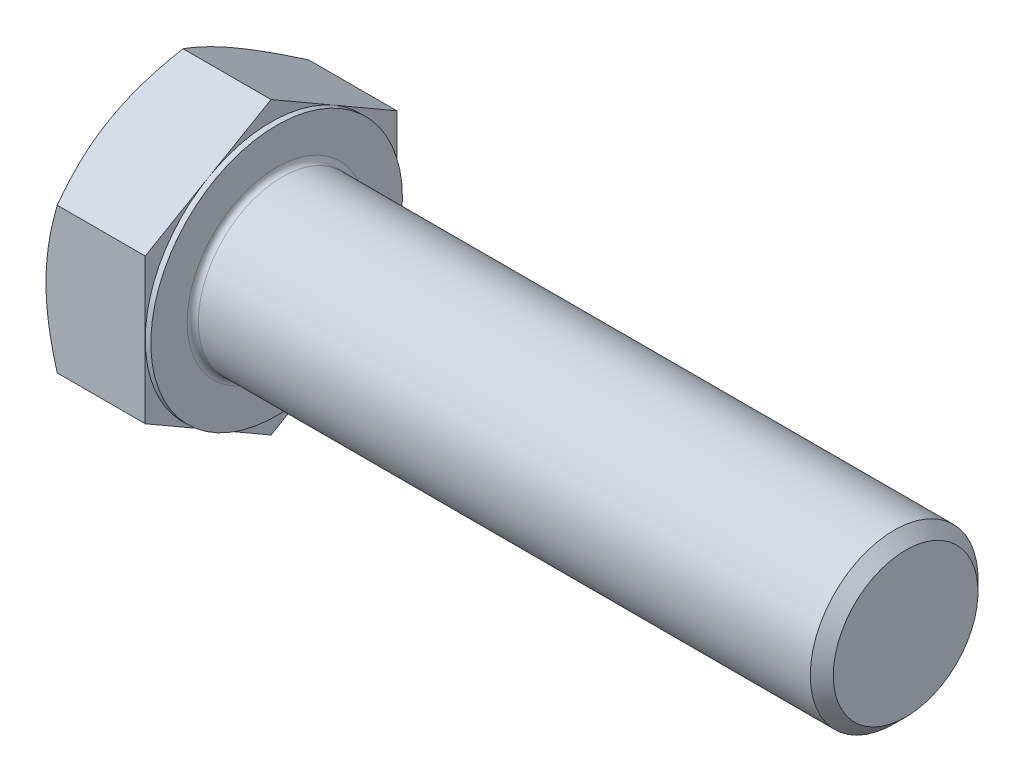
ISO-10303-21;
HEADER;
FILE_DESCRIPTION(('STEP AP214'),'2;1');
FILE_NAME('part.step','',(''),(''),'','','');
FILE_SCHEMA(('AUTOMOTIVE_DESIGN { 1 0 10303 214 1 1 1 1 }'));
ENDSEC;
DATA;
#1=APPLICATION_CONTEXT('core data for automotive mechanical design processes');
#2=APPLICATION_PROTOCOL_DEFINITION('international standard','automotive_design',2000,#1);
#3=PRODUCT_CONTEXT('',#1,'mechanical');
#4=PRODUCT('Part','Part','',(#3));
#5=PRODUCT_RELATED_PRODUCT_CATEGORY('part','',(#4));
#6=PRODUCT_DEFINITION_FORMATION('','',#4);
#7=PRODUCT_DEFINITION_CONTEXT('part definition',#1,'design');
#8=PRODUCT_DEFINITION('design','',#6,#7);
#9=PRODUCT_DEFINITION_SHAPE('','',#8);
#10=(LENGTH_UNIT() NAMED_UNIT(*) SI_UNIT(.MILLI.,.METRE.));
#11=(NAMED_UNIT(*) PLANE_ANGLE_UNIT() SI_UNIT($,.RADIAN.));
#12=(NAMED_UNIT(*) SI_UNIT($,.STERADIAN.) SOLID_ANGLE_UNIT());
#13=UNCERTAINTY_MEASURE_WITH_UNIT(LENGTH_MEASURE(1.E-05),#10,'distance_accuracy_value','');
#14=(GEOMETRIC_REPRESENTATION_CONTEXT(3) GLOBAL_UNCERTAINTY_ASSIGNED_CONTEXT((#13)) GLOBAL_UNIT_ASSIGNED_CONTEXT((#10,
#11,#12)) REPRESENTATION_CONTEXT('',''));
#15=CARTESIAN_POINT('',(0.,0.,0.));
#16=DIRECTION('',(0.,0.,1.));
#17=DIRECTION('',(1.,0.,0.));
#18=AXIS2_PLACEMENT_3D('',#15,#16,#17);
#19=CARTESIAN_POINT('',(-12.1093803991354,180.121959397122,17.5692415429333));
#20=DIRECTION('',(1.,0.,0.));
#21=DIRECTION('',(0.,0.,-1.));
#22=AXIS2_PLACEMENT_3D('',#19,#20,#21);
#23=PLANE('',#22);
#24=CARTESIAN_POINT('',(-12.1093803991354,159.337349706295,17.5692415429333));
#25=DIRECTION('',(1.,0.,0.));
#26=DIRECTION('',(0.,0.,-1.));
#27=AXIS2_PLACEMENT_3D('',#24,#25,#26);
#28=CIRCLE('',#27,12.8);
#29=CARTESIAN_POINT('',(-12.1093803991354,159.337349706295,4.76924154293326));
#30=VERTEX_POINT('',#29);
#31=EDGE_CURVE('E40',#30,#30,#28,.F.);
#32=ORIENTED_EDGE('',*,*,#31,.T.);
#33=EDGE_LOOP('',(#32));
#34=FACE_BOUND('',#33,.T.);
#35=CARTESIAN_POINT('',(-12.1093803991354,159.337349706295,17.5692415429333));
#36=DIRECTION('',(1.,0.,0.));
#37=DIRECTION('',(0.,0.,-1.));
#38=AXIS2_PLACEMENT_3D('',#35,#36,#37);
#39=CIRCLE('',#38,18.);
#40=CARTESIAN_POINT('',(-12.1093803991354,159.337349706295,-0.430758457066735));
#41=VERTEX_POINT('',#40);
#42=EDGE_CURVE('E297',#41,#41,#39,.T.);
#43=ORIENTED_EDGE('',*,*,#42,.T.);
#44=EDGE_LOOP('',(#43));
#45=FACE_BOUND('',#44,.T.);
#46=ADVANCED_FACE('F32',(#34,#45),#23,.T.);
#47=CARTESIAN_POINT('',(-27.1093803991354,159.337349706295,17.5692415429333));
#48=DIRECTION('',(-1.,0.,0.));
#49=DIRECTION('',(0.,0.,1.));
#50=AXIS2_PLACEMENT_3D('',#47,#48,#49);
#51=CYLINDRICAL_SURFACE('',#50,12.);
#52=CARTESIAN_POINT('',(-11.3093803991354,159.337349706295,17.5692415429333));
#53=DIRECTION('',(1.,0.,0.));
#54=DIRECTION('',(0.,0.,-1.));
#55=AXIS2_PLACEMENT_3D('',#52,#53,#54);
#56=CIRCLE('',#55,12.);
#57=CARTESIAN_POINT('',(-11.3093803991354,159.337349706295,5.56924154293326));
#58=VERTEX_POINT('',#57);
#59=EDGE_CURVE('E11',#58,#58,#56,.T.);
#60=ORIENTED_EDGE('',*,*,#59,.T.);
#61=EDGE_LOOP('',(#60));
#62=FACE_BOUND('',#61,.T.);
#63=CARTESIAN_POINT('',(76.2426196008646,159.337349706295,17.5692415429333));
#64=DIRECTION('',(-1.,0.,0.));
#65=DIRECTION('',(0.,0.,1.));
#66=AXIS2_PLACEMENT_3D('',#63,#64,#65);
#67=CIRCLE('',#66,12.);
#68=CARTESIAN_POINT('',(76.2426196008646,159.337349706295,29.5692415429333));
#69=VERTEX_POINT('',#68);
#70=EDGE_CURVE('E276',#69,#69,#67,.T.);
#71=ORIENTED_EDGE('',*,*,#70,.T.);
#72=EDGE_LOOP('',(#71));
#73=FACE_BOUND('',#72,.T.);
#74=ADVANCED_FACE('F250',(#62,#73),#51,.T.);
#75=CARTESIAN_POINT('',(77.8906196008646,159.337349706295,17.5692415429333));
#76=DIRECTION('',(-1.,0.,0.));
#77=DIRECTION('',(0.,0.,1.));
#78=AXIS2_PLACEMENT_3D('',#75,#76,#77);
#79=CONICAL_SURFACE('',#78,10.352,0.785398163397449);
#80=ORIENTED_EDGE('',*,*,#70,.F.);
#81=EDGE_LOOP('',(#80));
#82=FACE_BOUND('',#81,.T.);
#83=CARTESIAN_POINT('',(77.8906196008646,159.337349706295,17.5692415429333));
#84=DIRECTION('',(-1.,0.,0.));
#85=DIRECTION('',(0.,0.,1.));
#86=AXIS2_PLACEMENT_3D('',#83,#84,#85);
#87=CIRCLE('',#86,10.352);
#88=CARTESIAN_POINT('',(77.8906196008646,159.337349706295,27.9212415429333));
#89=VERTEX_POINT('',#88);
#90=EDGE_CURVE('E274',#89,#89,#87,.T.);
#91=ORIENTED_EDGE('',*,*,#90,.T.);
#92=EDGE_LOOP('',(#91));
#93=FACE_BOUND('',#92,.T.);
#94=ADVANCED_FACE('F255',(#82,#93),#79,.T.);
#95=CARTESIAN_POINT('',(77.8906196008646,159.337349706295,17.5692415429333));
#96=DIRECTION('',(-1.,0.,0.));
#97=DIRECTION('',(0.,0.,1.));
#98=AXIS2_PLACEMENT_3D('',#95,#96,#97);
#99=PLANE('',#98);
#100=ORIENTED_EDGE('',*,*,#90,.F.);
#101=EDGE_LOOP('',(#100));
#102=FACE_BOUND('',#101,.T.);
#103=ADVANCED_FACE('F262',(#102),#99,.F.);
#104=CARTESIAN_POINT('',(-12.9093803991354,177.337349706295,17.5692415429333));
#105=DIRECTION('',(1.,0.,0.));
#106=DIRECTION('',(0.,0.,-1.));
#107=AXIS2_PLACEMENT_3D('',#104,#105,#106);
#108=PLANE('',#107);
#109=DIRECTION('',(0.,0.500000000000001,0.866025403784438));
#110=VECTOR('',#109,1.);
#111=CARTESIAN_POINT('',(-12.9093803991354,169.729654551709,-0.430758457066735));
#112=LINE('',#111,#110);
#113=CARTESIAN_POINT('',(-12.9093803991354,169.729654551709,-0.430758457066735));
#114=VERTEX_POINT('',#113);
#115=CARTESIAN_POINT('',(-12.9093803991354,174.925806974415,8.56924154293324));
#116=VERTEX_POINT('',#115);
#117=EDGE_CURVE('E164',#114,#116,#112,.T.);
#118=ORIENTED_EDGE('',*,*,#117,.T.);
#119=CARTESIAN_POINT('',(-12.9093803991354,159.337349706295,17.5692415429333));
#120=DIRECTION('',(-1.,0.,0.));
#121=DIRECTION('',(0.,0.,1.));
#122=AXIS2_PLACEMENT_3D('',#119,#120,#121);
#123=CIRCLE('',#122,18.);
#124=CARTESIAN_POINT('',(-12.9093803991354,159.337349706295,-0.430758457066735));
#125=VERTEX_POINT('',#124);
#126=EDGE_CURVE('E47',#116,#125,#123,.T.);
#127=ORIENTED_EDGE('',*,*,#126,.T.);
#128=DIRECTION('',(0.,1.,0.));
#129=VECTOR('',#128,1.);
#130=CARTESIAN_POINT('',(-12.9093803991354,169.729654551709,-0.430758457066735));
#131=LINE('',#130,#129);
#132=EDGE_CURVE('E300',#125,#114,#131,.T.);
#133=ORIENTED_EDGE('',*,*,#132,.T.);
#134=EDGE_LOOP('',(#118,#127,#133));
#135=FACE_BOUND('',#134,.T.);
#136=ADVANCED_FACE('F265',(#135),#108,.T.);
#137=CARTESIAN_POINT('',(-12.9093803991354,180.121959397122,17.5692415429333));
#138=VERTEX_POINT('',#137);
#139=EDGE_CURVE('E162',#116,#138,#112,.T.);
#140=ORIENTED_EDGE('',*,*,#139,.T.);
#141=DIRECTION('',(0.,-0.500000000000001,0.866025403784438));
#142=VECTOR('',#141,1.);
#143=CARTESIAN_POINT('',(-12.9093803991354,180.121959397122,17.5692415429333));
#144=LINE('',#143,#142);
#145=CARTESIAN_POINT('',(-12.9093803991354,174.925806974415,26.5692415429333));
#146=VERTEX_POINT('',#145);
#147=EDGE_CURVE('E161',#138,#146,#144,.T.);
#148=ORIENTED_EDGE('',*,*,#147,.T.);
#149=EDGE_CURVE('E150',#146,#116,#123,.T.);
#150=ORIENTED_EDGE('',*,*,#149,.T.);
#151=EDGE_LOOP('',(#140,#148,#150));
#152=FACE_BOUND('',#151,.T.);
#153=ADVANCED_FACE('F270',(#152),#108,.T.);
#154=CARTESIAN_POINT('',(-12.9093803991354,169.729654551709,35.5692415429333));
#155=VERTEX_POINT('',#154);
#156=EDGE_CURVE('E129',#146,#155,#144,.T.);
#157=ORIENTED_EDGE('',*,*,#156,.T.);
#158=DIRECTION('',(0.,-1.,0.));
#159=VECTOR('',#158,1.);
#160=CARTESIAN_POINT('',(-12.9093803991354,169.729654551709,35.5692415429333));
#161=LINE('',#160,#159);
#162=CARTESIAN_POINT('',(-12.9093803991354,159.337349706295,35.5692415429333));
#163=VERTEX_POINT('',#162);
#164=EDGE_CURVE('E123',#155,#163,#161,.T.);
#165=ORIENTED_EDGE('',*,*,#164,.T.);
#166=EDGE_CURVE('E127',#163,#146,#123,.T.);
#167=ORIENTED_EDGE('',*,*,#166,.T.);
#168=EDGE_LOOP('',(#157,#165,#167));
#169=FACE_BOUND('',#168,.T.);
#170=ADVANCED_FACE('F125',(#169),#108,.T.);
#171=CARTESIAN_POINT('',(-12.9093803991354,148.945044860882,35.5692415429333));
#172=VERTEX_POINT('',#171);
#173=EDGE_CURVE('E133',#163,#172,#161,.T.);
#174=ORIENTED_EDGE('',*,*,#173,.T.);
#175=DIRECTION('',(0.,-0.500000000000002,-0.866025403784438));
#176=VECTOR('',#175,1.);
#177=CARTESIAN_POINT('',(-12.9093803991354,138.552740015469,17.5692415429333));
#178=LINE('',#177,#176);
#179=CARTESIAN_POINT('',(-12.9093803991354,143.748892438175,26.5692415429333));
#180=VERTEX_POINT('',#179);
#181=EDGE_CURVE('E140',#172,#180,#178,.T.);
#182=ORIENTED_EDGE('',*,*,#181,.T.);
#183=EDGE_CURVE('E137',#180,#163,#123,.T.);
#184=ORIENTED_EDGE('',*,*,#183,.T.);
#185=EDGE_LOOP('',(#174,#182,#184));
#186=FACE_BOUND('',#185,.T.);
#187=ADVANCED_FACE('F138',(#186),#108,.T.);
#188=CARTESIAN_POINT('',(-12.9093803991354,138.552740015469,17.5692415429333));
#189=VERTEX_POINT('',#188);
#190=EDGE_CURVE('E156',#180,#189,#178,.T.);
#191=ORIENTED_EDGE('',*,*,#190,.T.);
#192=DIRECTION('',(0.,0.5,-0.866025403784439));
#193=VECTOR('',#192,1.);
#194=CARTESIAN_POINT('',(-12.9093803991354,148.945044860882,-0.430758457066735));
#195=LINE('',#194,#193);
#196=CARTESIAN_POINT('',(-12.9093803991354,143.748892438175,8.56924154293327));
#197=VERTEX_POINT('',#196);
#198=EDGE_CURVE('E338',#189,#197,#195,.T.);
#199=ORIENTED_EDGE('',*,*,#198,.T.);
#200=EDGE_CURVE('E144',#197,#180,#123,.T.);
#201=ORIENTED_EDGE('',*,*,#200,.T.);
#202=EDGE_LOOP('',(#191,#199,#201));
#203=FACE_BOUND('',#202,.T.);
#204=ADVANCED_FACE('F339',(#203),#108,.T.);
#205=CARTESIAN_POINT('',(-12.9093803991354,148.945044860882,-0.430758457066735));
#206=VERTEX_POINT('',#205);
#207=EDGE_CURVE('E151',#197,#206,#195,.T.);
#208=ORIENTED_EDGE('',*,*,#207,.T.);
#209=EDGE_CURVE('E301',#206,#125,#131,.T.);
#210=ORIENTED_EDGE('',*,*,#209,.T.);
#211=EDGE_CURVE('E308',#125,#197,#123,.T.);
#212=ORIENTED_EDGE('',*,*,#211,.T.);
#213=EDGE_LOOP('',(#208,#210,#212));
#214=FACE_BOUND('',#213,.T.);
#215=ADVANCED_FACE('F271',(#214),#108,.T.);
#216=CARTESIAN_POINT('',(-27.1093803991354,159.337349706295,17.5692415429333));
#217=DIRECTION('',(-1.,0.,0.));
#218=DIRECTION('',(0.,0.,1.));
#219=AXIS2_PLACEMENT_3D('',#216,#217,#218);
#220=CYLINDRICAL_SURFACE('',#219,18.);
#221=ORIENTED_EDGE('',*,*,#126,.F.);
#222=ORIENTED_EDGE('',*,*,#149,.F.);
#223=ORIENTED_EDGE('',*,*,#166,.F.);
#224=ORIENTED_EDGE('',*,*,#183,.F.);
#225=ORIENTED_EDGE('',*,*,#200,.F.);
#226=ORIENTED_EDGE('',*,*,#211,.F.);
#227=EDGE_LOOP('',(#221,#222,#223,#224,#225,#226));
#228=FACE_BOUND('',#227,.T.);
#229=ORIENTED_EDGE('',*,*,#42,.F.);
#230=EDGE_LOOP('',(#229));
#231=FACE_BOUND('',#230,.T.);
#232=ADVANCED_FACE('F147',(#228,#231),#220,.T.);
#233=CARTESIAN_POINT('',(-27.1093803991354,180.121959397122,17.5692415429333));
#234=DIRECTION('',(1.,0.,0.));
#235=DIRECTION('',(0.,0.,-1.));
#236=AXIS2_PLACEMENT_3D('',#233,#234,#235);
#237=PLANE('',#236);
#238=CARTESIAN_POINT('',(-27.1093803991354,159.337349706295,17.5692415429333));
#239=DIRECTION('',(1.,0.,0.));
#240=DIRECTION('',(0.,0.,-1.));
#241=AXIS2_PLACEMENT_3D('',#238,#239,#240);
#242=CIRCLE('',#241,18.);
#243=CARTESIAN_POINT('',(-27.1093803991354,159.337349706295,-0.430758457066735));
#244=VERTEX_POINT('',#243);
#245=CARTESIAN_POINT('',(-27.1093803991354,174.925806974415,8.56924154293324));
#246=VERTEX_POINT('',#245);
#247=EDGE_CURVE('E296',#244,#246,#242,.T.);
#248=ORIENTED_EDGE('',*,*,#247,.F.);
#249=CARTESIAN_POINT('',(-27.1093803991354,143.748892438175,8.56924154293327));
#250=VERTEX_POINT('',#249);
#251=EDGE_CURVE('E292',#250,#244,#242,.T.);
#252=ORIENTED_EDGE('',*,*,#251,.F.);
#253=CARTESIAN_POINT('',(-27.1093803991354,143.748892438176,26.5692415429333));
#254=VERTEX_POINT('',#253);
#255=EDGE_CURVE('E295',#254,#250,#242,.T.);
#256=ORIENTED_EDGE('',*,*,#255,.F.);
#257=CARTESIAN_POINT('',(-27.1093803991354,159.337349706295,35.5692415429333));
#258=VERTEX_POINT('',#257);
#259=EDGE_CURVE('E331',#258,#254,#242,.T.);
#260=ORIENTED_EDGE('',*,*,#259,.F.);
#261=CARTESIAN_POINT('',(-27.1093803991354,159.337349706295,17.5692415429333));
#262=DIRECTION('',(-1.,0.,0.));
#263=DIRECTION('',(0.,0.,1.));
#264=AXIS2_PLACEMENT_3D('',#261,#262,#263);
#265=CIRCLE('',#264,18.);
#266=CARTESIAN_POINT('',(-27.1093803991354,174.925806974415,26.5692415429333));
#267=VERTEX_POINT('',#266);
#268=EDGE_CURVE('E165',#258,#267,#265,.T.);
#269=ORIENTED_EDGE('',*,*,#268,.T.);
#270=EDGE_CURVE('E354',#246,#267,#242,.T.);
#271=ORIENTED_EDGE('',*,*,#270,.F.);
#272=EDGE_LOOP('',(#248,#252,#256,#260,#269,#271));
#273=FACE_BOUND('',#272,.T.);
#274=ADVANCED_FACE('F196',(#273),#237,.F.);
#275=CARTESIAN_POINT('',(-27.1093803991354,159.337349706295,17.5692415429333));
#276=DIRECTION('',(1.,0.,0.));
#277=DIRECTION('',(0.,0.,-1.));
#278=AXIS2_PLACEMENT_3D('',#275,#276,#277);
#279=CONICAL_SURFACE('',#278,18.,1.0471975511966);
#280=CARTESIAN_POINT('',(-25.5016185773265,169.729539081655,35.5694415429333));
#281=CARTESIAN_POINT('',(-25.6334870335723,169.95795766295,35.1738089547374));
#282=CARTESIAN_POINT('',(-25.7593715089236,170.187267199312,34.7766331870977));
#283=CARTESIAN_POINT('',(-25.9975091630245,170.647725062304,33.9790967736508));
#284=CARTESIAN_POINT('',(-26.1097578584761,170.878873967226,33.5787351262127));
#285=CARTESIAN_POINT('',(-26.3191151015515,171.343457305625,32.7740531797557));
#286=CARTESIAN_POINT('',(-26.4161878259944,171.576895804655,32.3697258389935));
#287=CARTESIAN_POINT('',(-26.5931086553478,172.045394858678,31.5582616741278));
#288=CARTESIAN_POINT('',(-26.6729577467147,172.280455319979,31.1511250123028));
#289=CARTESIAN_POINT('',(-26.8120350962806,172.746175254739,30.3444744232004));
#290=CARTESIAN_POINT('',(-26.8717236760218,172.976800153292,29.9450203814168));
#291=CARTESIAN_POINT('',(-26.971808023466,173.43910670656,29.144281942484));
#292=CARTESIAN_POINT('',(-27.0122034198103,173.670788381531,28.7429975102531));
#293=CARTESIAN_POINT('',(-27.0726814403179,174.134540914056,27.9397545617803));
#294=CARTESIAN_POINT('',(-27.0927882020966,174.366610979347,27.5377974177807));
#295=CARTESIAN_POINT('',(-27.112256545138,174.83096531831,26.7335121099819));
#296=CARTESIAN_POINT('',(-27.1116187674266,175.063249585141,26.3311839580315));
#297=CARTESIAN_POINT('',(-27.0910468196391,175.497510377678,25.5790222016222));
#298=CARTESIAN_POINT('',(-27.0736212147348,175.699517844448,25.229135005669));
#299=CARTESIAN_POINT('',(-27.0234113306342,176.10305091244,24.5301952293714));
#300=CARTESIAN_POINT('',(-26.9906272713992,176.304576520523,24.1811426371457));
#301=CARTESIAN_POINT('',(-26.9102693415567,176.707069518499,23.4840043149604));
#302=CARTESIAN_POINT('',(-26.8626820965706,176.90803623712,23.1359197476797));
#303=CARTESIAN_POINT('',(-26.753557522568,177.309012986273,22.4414076454919));
#304=CARTESIAN_POINT('',(-26.6920202526628,177.509023020857,22.0949801035698));
#305=CARTESIAN_POINT('',(-26.4849183234269,178.116179272866,21.0433546269562));
#306=CARTESIAN_POINT('',(-26.3187029312023,178.521567227865,20.3412020921213));
#307=CARTESIAN_POINT('',(-25.9414622288366,179.326298392165,18.9473668291207));
#308=CARTESIAN_POINT('',(-25.7305255120077,179.725651904305,18.2556662559121));
#309=CARTESIAN_POINT('',(-25.5016185773265,180.122074867176,17.5690415429333));
#310=B_SPLINE_CURVE_WITH_KNOTS('',3,(#280,#281,#282,#283,#284,#285,#286,#287,#288,#289,#290,
#291,#292,#293,#294,#295,#296,#297,#298,#299,#300,#301,#302,#303,#304,#305,#306,#307,#308,#309),
.UNSPECIFIED.,.F.,.F.,(4,2,2,2,2,2,2,2,2,2,2,2,2,2,4),(0.,1.42650335783821,2.85347447244914,
4.28376471280638,5.71397301377359,7.10888071673007,8.50381526803679,9.8970882864255,
11.2903182514068,12.5031974791545,13.7160593367768,14.9300201888636,16.1439758970578,
18.6253607678546,21.1018751738864),.UNSPECIFIED.);
#311=CARTESIAN_POINT('',(-25.5016852445487,180.121959397122,17.5692415429333));
#312=VERTEX_POINT('',#311);
#313=EDGE_CURVE('E216',#267,#312,#310,.T.);
#314=ORIENTED_EDGE('',*,*,#313,.T.);
#315=CARTESIAN_POINT('',(-25.5016185773265,180.122074867176,17.5694415429333));
#316=CARTESIAN_POINT('',(-25.6334870335723,179.893656285881,17.1738089547374));
#317=CARTESIAN_POINT('',(-25.7593715089236,179.664346749518,16.7766331870977));
#318=CARTESIAN_POINT('',(-25.9975091630244,179.203888886526,15.9790967736508));
#319=CARTESIAN_POINT('',(-26.1097578584761,178.972739981605,15.5787351262127));
#320=CARTESIAN_POINT('',(-26.3191151015515,178.508156643206,14.7740531797557));
#321=CARTESIAN_POINT('',(-26.4161878259944,178.274718144176,14.3697258389935));
#322=CARTESIAN_POINT('',(-26.5931086553478,177.806219090153,13.5582616741278));
#323=CARTESIAN_POINT('',(-26.6729577467147,177.571158628851,13.1511250123028));
#324=CARTESIAN_POINT('',(-26.8120350962806,177.105438694091,12.3444744232004));
#325=CARTESIAN_POINT('',(-26.8717236760218,176.874813795538,11.9450203814168));
#326=CARTESIAN_POINT('',(-26.971808023466,176.41250724227,11.144281942484));
#327=CARTESIAN_POINT('',(-27.0122034198103,176.1808255673,10.7429975102531));
#328=CARTESIAN_POINT('',(-27.0726814403179,175.717073034775,9.9397545617803));
#329=CARTESIAN_POINT('',(-27.0927882020966,175.485002969484,9.53779741778064));
#330=CARTESIAN_POINT('',(-27.112256545138,175.020648630521,8.73351210998189));
#331=CARTESIAN_POINT('',(-27.1116187674266,174.78836436369,8.33118395803148));
#332=CARTESIAN_POINT('',(-27.0910468196391,174.354103571153,7.57902220162215));
#333=CARTESIAN_POINT('',(-27.0736212147348,174.152096104383,7.22913500566904));
#334=CARTESIAN_POINT('',(-27.0234113306342,173.74856303639,6.53019522937135));
#335=CARTESIAN_POINT('',(-26.9906272713992,173.547037428307,6.18114263714568));
#336=CARTESIAN_POINT('',(-26.9102693415568,173.144544430331,5.48400431496042));
#337=CARTESIAN_POINT('',(-26.8626820965706,172.943577711711,5.13591974767973));
#338=CARTESIAN_POINT('',(-26.753557522568,172.542600962557,4.44140764549193));
#339=CARTESIAN_POINT('',(-26.6920202526628,172.342590927974,4.09498010356977));
#340=CARTESIAN_POINT('',(-26.4849183234269,171.735434675965,3.04335462695626));
#341=CARTESIAN_POINT('',(-26.3187029312023,171.330046720965,2.34120209212128));
#342=CARTESIAN_POINT('',(-25.9414622288366,170.525315556666,0.94736682912068));
#343=CARTESIAN_POINT('',(-25.7305255120077,170.125962044525,0.255666255912141));
#344=CARTESIAN_POINT('',(-25.5016185773265,169.729539081655,-0.430958457066734));
#345=B_SPLINE_CURVE_WITH_KNOTS('',3,(#315,#316,#317,#318,#319,#320,#321,#322,#323,#324,#325,
#326,#327,#328,#329,#330,#331,#332,#333,#334,#335,#336,#337,#338,#339,#340,#341,#342,#343,#344),
.UNSPECIFIED.,.F.,.F.,(4,2,2,2,2,2,2,2,2,2,2,2,2,2,4),(0.,1.42650335783821,2.85347447244914,
4.2837647128064,5.7139730137736,7.10888071673009,8.50381526803682,9.8970882864255,
11.2903182514067,12.5031974791544,13.7160593367767,14.9300201888636,16.1439758970578,
18.6253607678546,21.1018751738864),.UNSPECIFIED.);
#346=EDGE_CURVE('E55',#312,#246,#345,.T.);
#347=ORIENTED_EDGE('',*,*,#346,.T.);
#348=ORIENTED_EDGE('',*,*,#270,.T.);
#349=EDGE_LOOP('',(#314,#347,#348));
#350=FACE_BOUND('',#349,.T.);
#351=ADVANCED_FACE('F355',(#350),#279,.T.);
#352=CARTESIAN_POINT('',(-18.3009532686394,131.373009463191,35.5692415429333));
#353=CARTESIAN_POINT('',(-18.4918736211131,131.766283498899,35.5692415429333));
#354=CARTESIAN_POINT('',(-18.6818456718127,132.160017682992,35.5692415429333));
#355=CARTESIAN_POINT('',(-19.0596785002171,132.94850235425,35.5692415429333));
#356=CARTESIAN_POINT('',(-19.2475392568321,133.343252851518,35.5692415429333));
#357=CARTESIAN_POINT('',(-19.8076817656702,134.529277242871,35.5692415429333));
#358=CARTESIAN_POINT('',(-20.17646750514,135.322208481026,35.5692415429333));
#359=CARTESIAN_POINT('',(-20.9044707276029,136.917652303544,35.5692415429333));
#360=CARTESIAN_POINT('',(-21.2636256163045,137.720193518082,35.5692415429333));
#361=CARTESIAN_POINT('',(-21.9673097525373,139.331640778876,35.5692415429333));
#362=CARTESIAN_POINT('',(-22.3118396876511,140.140546523785,35.5692415429333));
#363=CARTESIAN_POINT('',(-22.9932701765611,141.792345519646,35.5692415429333));
#364=CARTESIAN_POINT('',(-23.3295623043063,142.635491079262,35.5692415429333));
#365=CARTESIAN_POINT('',(-23.9768152512855,144.331634274204,35.5692415429333));
#366=CARTESIAN_POINT('',(-24.2877732342435,145.184633000466,35.5692415429333));
#367=CARTESIAN_POINT('',(-24.8762258489713,146.900231032735,35.5692415429333));
#368=CARTESIAN_POINT('',(-25.1537878047741,147.762807060226,35.5692415429333));
#369=CARTESIAN_POINT('',(-25.6665900871678,149.50041427916,35.5692415429333));
#370=CARTESIAN_POINT('',(-25.9018436922953,150.37544146942,35.5692415429332));
#371=CARTESIAN_POINT('',(-26.2138580910769,151.695045428285,35.5692415429333));
#372=CARTESIAN_POINT('',(-26.3108404388274,152.134869587616,35.5692415429333));
#373=CARTESIAN_POINT('',(-26.4900337351555,153.017532391904,35.5692415429333));
#374=CARTESIAN_POINT('',(-26.5722449852231,153.460370975142,35.5692415429333));
#375=CARTESIAN_POINT('',(-26.7204465910115,154.348752678401,35.5692415429333));
#376=CARTESIAN_POINT('',(-26.7864374878894,154.794295707685,35.5692415429333));
#377=CARTESIAN_POINT('',(-26.9008880155577,155.687643395286,35.5692415429333));
#378=CARTESIAN_POINT('',(-26.9493476577856,156.135448052126,35.5692415429333));
#379=CARTESIAN_POINT('',(-27.0271583916056,157.02680007688,35.5692415429333));
#380=CARTESIAN_POINT('',(-27.0567520274169,157.470326141498,35.5692415429333));
#381=CARTESIAN_POINT('',(-27.0971538599202,158.358231577373,35.5692415429333));
#382=CARTESIAN_POINT('',(-27.1079623694995,158.802610934294,35.5692415429333));
#383=CARTESIAN_POINT('',(-27.1105367167562,159.691429413143,35.5692415429333));
#384=CARTESIAN_POINT('',(-27.1023024785232,160.135868535302,35.5692415429333));
#385=CARTESIAN_POINT('',(-27.0669927316031,161.024002541244,35.5692415429333));
#386=CARTESIAN_POINT('',(-27.0399163780053,161.467697390758,35.5692415429333));
#387=CARTESIAN_POINT('',(-26.9528983062091,162.532555596998,35.5692415429333));
#388=CARTESIAN_POINT('',(-26.8840988707578,163.15300794801,35.5692415429333));
#389=CARTESIAN_POINT('',(-26.7133903407551,164.389343911945,35.5692415429333));
#390=CARTESIAN_POINT('',(-26.6114767845528,165.005226897769,35.5692415429333));
#391=CARTESIAN_POINT('',(-26.3781653688312,166.231825249035,35.5692415429333));
#392=CARTESIAN_POINT('',(-26.246744629709,166.842536220761,35.5692415429333));
#393=CARTESIAN_POINT('',(-25.9584322620981,168.057849429847,35.5692415429333));
#394=CARTESIAN_POINT('',(-25.8015410097026,168.662451757266,35.5692415429333));
#395=CARTESIAN_POINT('',(-25.4624003513525,169.878843353201,35.5692415429333));
#396=CARTESIAN_POINT('',(-25.2796679792278,170.490497029168,35.5692415429333));
#397=CARTESIAN_POINT('',(-24.8952330383669,171.70777968145,35.5692415429333));
#398=CARTESIAN_POINT('',(-24.6935303448349,172.313408618103,35.5692415429333));
#399=CARTESIAN_POINT('',(-24.274365192663,173.518939224165,35.5692415429333));
#400=CARTESIAN_POINT('',(-24.0569079239977,174.118842706651,35.5692415429333));
#401=CARTESIAN_POINT('',(-23.6088007156706,175.313673048995,35.5692415429333));
#402=CARTESIAN_POINT('',(-23.3781509277602,175.908599966007,35.5692415429333));
#403=CARTESIAN_POINT('',(-22.8207692489548,177.307570192023,35.5692415429333));
#404=CARTESIAN_POINT('',(-22.4893552426422,178.109745174299,35.5692415429333));
#405=CARTESIAN_POINT('',(-21.8104721977987,179.707292788704,35.5692415429333));
#406=CARTESIAN_POINT('',(-21.4630021758335,180.502665000616,35.5692415429333));
#407=CARTESIAN_POINT('',(-20.7552075328405,182.087866433836,35.5692415429333));
#408=CARTESIAN_POINT('',(-20.3948800650277,182.87769438067,35.5692415429333));
#409=CARTESIAN_POINT('',(-19.6639528946762,184.452550547673,35.5692415429333));
#410=CARTESIAN_POINT('',(-19.2933534099693,185.237578869194,35.5692415429333));
#411=CARTESIAN_POINT('',(-18.5433861129967,186.804482968188,35.5692415429333));
#412=CARTESIAN_POINT('',(-18.1640091655958,187.586354365714,35.5692415429333));
#413=CARTESIAN_POINT('',(-17.398372425512,189.146719255546,35.5692415429333));
#414=CARTESIAN_POINT('',(-17.0121126034287,189.925212733406,35.5692415429333));
#415=CARTESIAN_POINT('',(-16.2339347859542,191.479241161141,35.5692415429333));
#416=CARTESIAN_POINT('',(-15.8420175082311,192.254776470761,35.5692415429333));
#417=CARTESIAN_POINT('',(-15.0534018189689,193.803408063201,35.5692415429333));
#418=CARTESIAN_POINT('',(-14.6567034162803,194.576504350533,35.5692415429333));
#419=CARTESIAN_POINT('',(-13.5271661978229,196.763736368044,35.5692415429333));
#420=CARTESIAN_POINT('',(-12.7895834431896,198.175422180972,35.5692415429333));
#421=CARTESIAN_POINT('',(-11.3043148663409,200.993519713685,35.5692415429333));
#422=CARTESIAN_POINT('',(-10.5566286886457,202.399931245664,35.5692415429333));
#423=CARTESIAN_POINT('',(-9.05538754186123,205.205113841375,35.5692415429333));
#424=CARTESIAN_POINT('',(-8.30185181399654,206.603895209462,35.5692415429333));
#425=CARTESIAN_POINT('',(-7.16704586829943,208.699576771584,35.5692415429333));
#426=CARTESIAN_POINT('',(-6.78803712670729,209.397703385174,35.5692415429333));
#427=CARTESIAN_POINT('',(-6.02866875314527,210.793220177395,35.5692415429333));
#428=CARTESIAN_POINT('',(-5.6483091232896,211.490610357178,35.5692415429333));
#429=CARTESIAN_POINT('',(-5.26735172766281,212.187673942136,35.5692415429333));
#430=B_SPLINE_CURVE_WITH_KNOTS('',3,(#352,#353,#354,#355,#356,#357,#358,#359,#360,#361,#362,
#363,#364,#365,#366,#367,#368,#369,#370,#371,#372,#373,#374,#375,#376,#377,#378,#379,#380,#381,
#382,#383,#384,#385,#386,#387,#388,#389,#390,#391,#392,#393,#394,#395,#396,#397,#398,#399,#400,
#401,#402,#403,#404,#405,#406,#407,#408,#409,#410,#411,#412,#413,#414,#415,#416,#417,#418,#419,
#420,#421,#422,#423,#424,#425,#426,#427,#428,#429),.UNSPECIFIED.,.F.,.F.,(4,2,2,2,2,2,2,2,2,2,2,
2,2,2,2,2,2,2,2,2,2,2,2,2,2,2,2,2,2,2,2,2,2,2,2,2,2,2,4),(0.,1.31149885283057,2.62301079472825,
5.24642021614435,7.88402931842205,10.5215142775822,13.2444150325257,15.9676202112372,
18.6852401997084,21.402005765065,22.7529669019192,24.1039004614305,25.454788943841,
26.8056765449329,28.1388267463277,29.4719547424042,30.8050880527688,32.138281146834,
34.0100119547707,35.8819950561187,37.7554347199951,39.628846723491,41.5435776020438,
43.4583210774805,45.3724366289069,47.286530166998,49.8901135940001,52.4938567029427,
55.0981799317037,57.7024479744958,60.3095605480866,62.9166842606504,65.5234801070603,
68.1302711287376,72.908489911859,77.6868772522354,82.4533702914907,84.8364880602421,
87.2196021009335),.UNSPECIFIED.);
#431=CARTESIAN_POINT('',(-25.5016852445487,169.729654551709,35.5692415429333));
#432=VERTEX_POINT('',#431);
#433=EDGE_CURVE('E230',#258,#432,#430,.T.);
#434=ORIENTED_EDGE('',*,*,#433,.T.);
#435=EDGE_CURVE('E229',#432,#267,#310,.T.);
#436=ORIENTED_EDGE('',*,*,#435,.T.);
#437=ORIENTED_EDGE('',*,*,#268,.F.);
#438=EDGE_LOOP('',(#434,#436,#437));
#439=FACE_BOUND('',#438,.T.);
#440=ADVANCED_FACE('F325',(#439),#279,.T.);
#441=CARTESIAN_POINT('',(-25.5016852445487,148.945044860882,35.5692415429333));
#442=VERTEX_POINT('',#441);
#443=EDGE_CURVE('E277',#442,#258,#430,.T.);
#444=ORIENTED_EDGE('',*,*,#443,.T.);
#445=ORIENTED_EDGE('',*,*,#259,.T.);
#446=CARTESIAN_POINT('',(-25.5016185773265,138.552624545415,17.5690415429333));
#447=CARTESIAN_POINT('',(-25.6334870335723,138.78104312671,17.9646741311292));
#448=CARTESIAN_POINT('',(-25.7593715089236,139.010352663072,18.3618498987688));
#449=CARTESIAN_POINT('',(-25.9975091630244,139.470810526065,19.1593863122157));
#450=CARTESIAN_POINT('',(-26.1097578584761,139.701959430986,19.5597479596538));
#451=CARTESIAN_POINT('',(-26.3191151015515,140.166542769385,20.3644299061108));
#452=CARTESIAN_POINT('',(-26.4161878259944,140.399981268415,20.7687572468731));
#453=CARTESIAN_POINT('',(-26.5931086553478,140.868480322438,21.5802214117387));
#454=CARTESIAN_POINT('',(-26.6729577467147,141.103540783739,21.9873580735637));
#455=CARTESIAN_POINT('',(-26.8120350962806,141.5692607185,22.7940086626661));
#456=CARTESIAN_POINT('',(-26.8717236760218,141.799885617052,23.1934627044497));
#457=CARTESIAN_POINT('',(-26.971808023466,142.262192170321,23.9942011433825));
#458=CARTESIAN_POINT('',(-27.0122034198103,142.493873845291,24.3954855756134));
#459=CARTESIAN_POINT('',(-27.0726814403179,142.957626377816,25.1987285240862));
#460=CARTESIAN_POINT('',(-27.0927882020966,143.189696443107,25.6006856680859));
#461=CARTESIAN_POINT('',(-27.112256545138,143.65405078207,26.4049709758846));
#462=CARTESIAN_POINT('',(-27.1116187674266,143.886335048901,26.807299127835));
#463=CARTESIAN_POINT('',(-27.0910468196391,144.320595841438,27.5594608842444));
#464=CARTESIAN_POINT('',(-27.0736212147348,144.522603308208,27.9093480801975));
#465=CARTESIAN_POINT('',(-27.0234113306342,144.926136376201,28.6082878564952));
#466=CARTESIAN_POINT('',(-26.9906272713992,145.127661984283,28.9573404487209));
#467=CARTESIAN_POINT('',(-26.9102693415568,145.530154982259,29.6544787709061));
#468=CARTESIAN_POINT('',(-26.8626820965706,145.73112170088,30.0025633381868));
#469=CARTESIAN_POINT('',(-26.753557522568,146.132098450033,30.6970754403746));
#470=CARTESIAN_POINT('',(-26.6920202526628,146.332108484617,31.0435029822968));
#471=CARTESIAN_POINT('',(-26.4849183234269,146.939264736626,32.0951284589103));
#472=CARTESIAN_POINT('',(-26.3187029312023,147.344652691625,32.7972809937453));
#473=CARTESIAN_POINT('',(-25.9414622288366,148.149383855925,34.1911162567458));
#474=CARTESIAN_POINT('',(-25.7305255120077,148.548737368065,34.8828168299544));
#475=CARTESIAN_POINT('',(-25.5016185773265,148.945160330936,35.5694415429333));
#476=B_SPLINE_CURVE_WITH_KNOTS('',3,(#446,#447,#448,#449,#450,#451,#452,#453,#454,#455,#456,
#457,#458,#459,#460,#461,#462,#463,#464,#465,#466,#467,#468,#469,#470,#471,#472,#473,#474,#475),
.UNSPECIFIED.,.F.,.F.,(4,2,2,2,2,2,2,2,2,2,2,2,2,2,4),(0.,1.4265033578382,2.85347447244912,
4.28376471280639,5.7139730137736,7.10888071673008,8.50381526803679,9.89708828642549,
11.2903182514068,12.5031974791545,13.7160593367768,14.9300201888637,16.1439758970578,
18.6253607678546,21.1018751738864),.UNSPECIFIED.);
#477=EDGE_CURVE('E218',#254,#442,#476,.T.);
#478=ORIENTED_EDGE('',*,*,#477,.T.);
#479=EDGE_LOOP('',(#444,#445,#478));
#480=FACE_BOUND('',#479,.T.);
#481=ADVANCED_FACE('F185',(#480),#279,.T.);
#482=CARTESIAN_POINT('',(-25.5016852445487,138.552740015469,17.5692415429333));
#483=VERTEX_POINT('',#482);
#484=EDGE_CURVE('E210',#483,#254,#476,.T.);
#485=ORIENTED_EDGE('',*,*,#484,.T.);
#486=ORIENTED_EDGE('',*,*,#255,.T.);
#487=CARTESIAN_POINT('',(-25.5016185773265,148.945160330936,-0.430958457066734));
#488=CARTESIAN_POINT('',(-25.6334870335723,148.716741749641,-0.0353258688708445));
#489=CARTESIAN_POINT('',(-25.7593715089236,148.487432213278,0.361849898768825));
#490=CARTESIAN_POINT('',(-25.9975091630244,148.026974350286,1.15938631221573));
#491=CARTESIAN_POINT('',(-26.1097578584761,147.795825445365,1.55974795965377));
#492=CARTESIAN_POINT('',(-26.3191151015515,147.331242106966,2.36442990611081));
#493=CARTESIAN_POINT('',(-26.4161878259944,147.097803607936,2.76875724687306));
#494=CARTESIAN_POINT('',(-26.5931086553478,146.629304553913,3.58022141173875));
#495=CARTESIAN_POINT('',(-26.6729577467147,146.394244092611,3.9873580735637));
#496=CARTESIAN_POINT('',(-26.8120350962806,145.928524157851,4.7940086626661));
#497=CARTESIAN_POINT('',(-26.8717236760218,145.697899259299,5.19346270444968));
#498=CARTESIAN_POINT('',(-26.971808023466,145.23559270603,5.99420114338255));
#499=CARTESIAN_POINT('',(-27.0122034198103,145.00391103106,6.39548557561344));
#500=CARTESIAN_POINT('',(-27.0726814403179,144.540158498535,7.19872852408622));
#501=CARTESIAN_POINT('',(-27.0927882020966,144.308088433244,7.60068566808589));
#502=CARTESIAN_POINT('',(-27.112256545138,143.843734094281,8.40497097588464));
#503=CARTESIAN_POINT('',(-27.1116187674266,143.61144982745,8.80729912783506));
#504=CARTESIAN_POINT('',(-27.091046819639,143.177189034913,9.55946088424438));
#505=CARTESIAN_POINT('',(-27.0736212147348,142.975181568143,9.9093480801975));
#506=CARTESIAN_POINT('',(-27.0234113306342,142.57164850015,10.6082878564952));
#507=CARTESIAN_POINT('',(-26.9906272713992,142.370122892068,10.9573404487208));
#508=CARTESIAN_POINT('',(-26.9102693415567,141.967629894091,11.6544787709061));
#509=CARTESIAN_POINT('',(-26.8626820965706,141.766663175471,12.0025633381868));
#510=CARTESIAN_POINT('',(-26.753557522568,141.365686426318,12.6970754403746));
#511=CARTESIAN_POINT('',(-26.6920202526628,141.165676391734,13.0435029822967));
#512=CARTESIAN_POINT('',(-26.4849183234269,140.558520139725,14.0951284589103));
#513=CARTESIAN_POINT('',(-26.3187029312023,140.153132184726,14.7972809937452));
#514=CARTESIAN_POINT('',(-25.9414622288366,139.348401020426,16.1911162567458));
#515=CARTESIAN_POINT('',(-25.7305255120077,138.949047508286,16.8828168299544));
#516=CARTESIAN_POINT('',(-25.5016185773265,138.552624545415,17.5694415429333));
#517=B_SPLINE_CURVE_WITH_KNOTS('',3,(#487,#488,#489,#490,#491,#492,#493,#494,#495,#496,#497,
#498,#499,#500,#501,#502,#503,#504,#505,#506,#507,#508,#509,#510,#511,#512,#513,#514,#515,#516),
.UNSPECIFIED.,.F.,.F.,(4,2,2,2,2,2,2,2,2,2,2,2,2,2,4),(0.,1.42650335783821,2.85347447244913,
4.28376471280641,5.71397301377358,7.10888071673007,8.50381526803681,9.89708828642549,
11.2903182514068,12.5031974791545,13.7160593367768,14.9300201888636,16.1439758970578,
18.6253607678546,21.1018751738864),.UNSPECIFIED.);
#518=EDGE_CURVE('E217',#250,#483,#517,.T.);
#519=ORIENTED_EDGE('',*,*,#518,.T.);
#520=EDGE_LOOP('',(#485,#486,#519));
#521=FACE_BOUND('',#520,.T.);
#522=ADVANCED_FACE('F353',(#521),#279,.T.);
#523=CARTESIAN_POINT('',(-25.5016852445487,169.729654551709,-0.430758457066735));
#524=VERTEX_POINT('',#523);
#525=EDGE_CURVE('E219',#246,#524,#345,.T.);
#526=ORIENTED_EDGE('',*,*,#525,.T.);
#527=CARTESIAN_POINT('',(-18.3009532686394,131.373009463191,-0.430758457066735));
#528=CARTESIAN_POINT('',(-18.4918736211131,131.766283498899,-0.430758457066735));
#529=CARTESIAN_POINT('',(-18.6818456718126,132.160017682992,-0.430758457066735));
#530=CARTESIAN_POINT('',(-19.0596785002171,132.94850235425,-0.430758457066735));
#531=CARTESIAN_POINT('',(-19.2475392568321,133.343252851518,-0.430758457066735));
#532=CARTESIAN_POINT('',(-19.8076817656702,134.529277242871,-0.430758457066735));
#533=CARTESIAN_POINT('',(-20.17646750514,135.322208481026,-0.430758457066735));
#534=CARTESIAN_POINT('',(-20.9044707276029,136.917652303544,-0.430758457066735));
#535=CARTESIAN_POINT('',(-21.2636256163045,137.720193518082,-0.430758457066735));
#536=CARTESIAN_POINT('',(-21.9673097525373,139.331640778876,-0.430758457066735));
#537=CARTESIAN_POINT('',(-22.311839687651,140.140546523785,-0.430758457066735));
#538=CARTESIAN_POINT('',(-22.9932701765611,141.792345519646,-0.430758457066735));
#539=CARTESIAN_POINT('',(-23.3295623043063,142.635491079262,-0.430758457066735));
#540=CARTESIAN_POINT('',(-23.9768152512855,144.331634274204,-0.430758457066735));
#541=CARTESIAN_POINT('',(-24.2877732342434,145.184633000466,-0.430758457066735));
#542=CARTESIAN_POINT('',(-24.8762258489713,146.900231032735,-0.430758457066735));
#543=CARTESIAN_POINT('',(-25.1537878047741,147.762807060226,-0.430758457066735));
#544=CARTESIAN_POINT('',(-25.6665900871678,149.50041427916,-0.430758457066735));
#545=CARTESIAN_POINT('',(-25.9018436922953,150.37544146942,-0.430758457066735));
#546=CARTESIAN_POINT('',(-26.2138580910769,151.695045428285,-0.430758457066735));
#547=CARTESIAN_POINT('',(-26.3108404388274,152.134869587616,-0.430758457066735));
#548=CARTESIAN_POINT('',(-26.4900337351555,153.017532391904,-0.430758457066735));
#549=CARTESIAN_POINT('',(-26.5722449852231,153.460370975142,-0.430758457066735));
#550=CARTESIAN_POINT('',(-26.7204465910115,154.348752678401,-0.430758457066735));
#551=CARTESIAN_POINT('',(-26.7864374878894,154.794295707685,-0.430758457066735));
#552=CARTESIAN_POINT('',(-26.9008880155577,155.687643395286,-0.430758457066735));
#553=CARTESIAN_POINT('',(-26.9493476577856,156.135448052126,-0.430758457066735));
#554=CARTESIAN_POINT('',(-27.0271583916056,157.02680007688,-0.430758457066735));
#555=CARTESIAN_POINT('',(-27.0567520274169,157.470326141498,-0.430758457066735));
#556=CARTESIAN_POINT('',(-27.0971538599202,158.358231577373,-0.430758457066735));
#557=CARTESIAN_POINT('',(-27.1079623694995,158.802610934294,-0.430758457066735));
#558=CARTESIAN_POINT('',(-27.1105367167562,159.691429413143,-0.430758457066735));
#559=CARTESIAN_POINT('',(-27.1023024785232,160.135868535302,-0.430758457066735));
#560=CARTESIAN_POINT('',(-27.0669927316031,161.024002541244,-0.430758457066735));
#561=CARTESIAN_POINT('',(-27.0399163780053,161.467697390758,-0.430758457066735));
#562=CARTESIAN_POINT('',(-26.9528983062091,162.532555596998,-0.430758457066735));
#563=CARTESIAN_POINT('',(-26.8840988707578,163.15300794801,-0.430758457066735));
#564=CARTESIAN_POINT('',(-26.7133903407551,164.389343911945,-0.430758457066735));
#565=CARTESIAN_POINT('',(-26.6114767845529,165.005226897769,-0.430758457066735));
#566=CARTESIAN_POINT('',(-26.3781653688312,166.231825249035,-0.430758457066735));
#567=CARTESIAN_POINT('',(-26.246744629709,166.842536220761,-0.430758457066735));
#568=CARTESIAN_POINT('',(-25.9584322620981,168.057849429847,-0.430758457066735));
#569=CARTESIAN_POINT('',(-25.8015410097026,168.662451757266,-0.430758457066735));
#570=CARTESIAN_POINT('',(-25.4624003513525,169.878843353201,-0.430758457066735));
#571=CARTESIAN_POINT('',(-25.2796679792278,170.490497029168,-0.430758457066735));
#572=CARTESIAN_POINT('',(-24.8952330383669,171.70777968145,-0.430758457066735));
#573=CARTESIAN_POINT('',(-24.6935303448349,172.313408618103,-0.430758457066735));
#574=CARTESIAN_POINT('',(-24.274365192663,173.518939224165,-0.430758457066735));
#575=CARTESIAN_POINT('',(-24.0569079239977,174.118842706651,-0.430758457066735));
#576=CARTESIAN_POINT('',(-23.6088007156706,175.313673048995,-0.430758457066735));
#577=CARTESIAN_POINT('',(-23.3781509277602,175.908599966007,-0.430758457066735));
#578=CARTESIAN_POINT('',(-22.8207692489548,177.307570192023,-0.430758457066735));
#579=CARTESIAN_POINT('',(-22.4893552426422,178.109745174299,-0.430758457066735));
#580=CARTESIAN_POINT('',(-21.8104721977987,179.707292788704,-0.430758457066735));
#581=CARTESIAN_POINT('',(-21.4630021758336,180.502665000616,-0.430758457066735));
#582=CARTESIAN_POINT('',(-20.7552075328405,182.087866433836,-0.430758457066735));
#583=CARTESIAN_POINT('',(-20.3948800650278,182.87769438067,-0.430758457066735));
#584=CARTESIAN_POINT('',(-19.6639528946762,184.452550547673,-0.430758457066735));
#585=CARTESIAN_POINT('',(-19.2933534099694,185.237578869194,-0.430758457066735));
#586=CARTESIAN_POINT('',(-18.5433861129967,186.804482968188,-0.430758457066735));
#587=CARTESIAN_POINT('',(-18.1640091655958,187.586354365713,-0.430758457066735));
#588=CARTESIAN_POINT('',(-17.398372425512,189.146719255546,-0.430758457066735));
#589=CARTESIAN_POINT('',(-17.0121126034287,189.925212733406,-0.430758457066735));
#590=CARTESIAN_POINT('',(-16.2339347859542,191.479241161141,-0.430758457066735));
#591=CARTESIAN_POINT('',(-15.8420175082311,192.254776470761,-0.430758457066735));
#592=CARTESIAN_POINT('',(-15.0534018189689,193.803408063201,-0.430758457066735));
#593=CARTESIAN_POINT('',(-14.6567034162803,194.576504350533,-0.430758457066735));
#594=CARTESIAN_POINT('',(-13.5271661978229,196.763736368044,-0.430758457066735));
#595=CARTESIAN_POINT('',(-12.7895834431897,198.175422180972,-0.430758457066735));
#596=CARTESIAN_POINT('',(-11.3043148663409,200.993519713685,-0.430758457066735));
#597=CARTESIAN_POINT('',(-10.5566286886457,202.399931245664,-0.430758457066735));
#598=CARTESIAN_POINT('',(-9.05538754186124,205.205113841375,-0.430758457066735));
#599=CARTESIAN_POINT('',(-8.30185181399655,206.603895209462,-0.430758457066735));
#600=CARTESIAN_POINT('',(-7.16704586829945,208.699576771584,-0.430758457066735));
#601=CARTESIAN_POINT('',(-6.78803712670731,209.397703385174,-0.430758457066735));
#602=CARTESIAN_POINT('',(-6.02866875314528,210.793220177395,-0.430758457066735));
#603=CARTESIAN_POINT('',(-5.6483091232896,211.490610357178,-0.430758457066735));
#604=CARTESIAN_POINT('',(-5.2673517276628,212.187673942136,-0.430758457066735));
#605=B_SPLINE_CURVE_WITH_KNOTS('',3,(#527,#528,#529,#530,#531,#532,#533,#534,#535,#536,#537,
#538,#539,#540,#541,#542,#543,#544,#545,#546,#547,#548,#549,#550,#551,#552,#553,#554,#555,#556,
#557,#558,#559,#560,#561,#562,#563,#564,#565,#566,#567,#568,#569,#570,#571,#572,#573,#574,#575,
#576,#577,#578,#579,#580,#581,#582,#583,#584,#585,#586,#587,#588,#589,#590,#591,#592,#593,#594,
#595,#596,#597,#598,#599,#600,#601,#602,#603,#604),.UNSPECIFIED.,.F.,.F.,(4,2,2,2,2,2,2,2,2,2,2,
2,2,2,2,2,2,2,2,2,2,2,2,2,2,2,2,2,2,2,2,2,2,2,2,2,2,2,4),(0.,1.31149885283057,2.62301079472828,
5.24642021614441,7.88402931842209,10.5215142775822,13.2444150325258,15.9676202112372,
18.6852401997085,21.402005765065,22.7529669019192,24.1039004614305,25.454788943841,
26.8056765449329,28.1388267463277,29.4719547424042,30.8050880527689,32.1382811468341,
34.0100119547707,35.8819950561187,37.7554347199952,39.6288467234911,41.5435776020438,
43.4583210774806,45.3724366289069,47.2865301669981,49.8901135940001,52.4938567029427,
55.0981799317037,57.7024479744958,60.3095605480867,62.9166842606505,65.5234801070603,
68.1302711287377,72.9084899118591,77.6868772522355,82.4533702914908,84.8364880602422,
87.2196021009336),.UNSPECIFIED.);
#606=EDGE_CURVE('E177',#524,#244,#605,.F.);
#607=ORIENTED_EDGE('',*,*,#606,.T.);
#608=ORIENTED_EDGE('',*,*,#247,.T.);
#609=EDGE_LOOP('',(#526,#607,#608));
#610=FACE_BOUND('',#609,.T.);
#611=ADVANCED_FACE('F350',(#610),#279,.T.);
#612=CARTESIAN_POINT('',(-25.5016852445487,148.945044860882,-0.430758457066735));
#613=VERTEX_POINT('',#612);
#614=EDGE_CURVE('E178',#613,#250,#517,.T.);
#615=ORIENTED_EDGE('',*,*,#614,.T.);
#616=ORIENTED_EDGE('',*,*,#251,.T.);
#617=EDGE_CURVE('E168',#244,#613,#605,.F.);
#618=ORIENTED_EDGE('',*,*,#617,.T.);
#619=EDGE_LOOP('',(#615,#616,#618));
#620=FACE_BOUND('',#619,.T.);
#621=ADVANCED_FACE('F194',(#620),#279,.T.);
#622=CARTESIAN_POINT('',(-12.1093803991354,169.729654551709,-0.430758457066735));
#623=DIRECTION('',(0.,0.,1.));
#624=DIRECTION('',(1.,0.,0.));
#625=AXIS2_PLACEMENT_3D('',#622,#623,#624);
#626=PLANE('',#625);
#627=ORIENTED_EDGE('',*,*,#209,.F.);
#628=DIRECTION('',(-1.,0.,0.));
#629=VECTOR('',#628,1.);
#630=CARTESIAN_POINT('',(-12.1093803991354,148.945044860882,-0.430758457066735));
#631=LINE('',#630,#629);
#632=EDGE_CURVE('E283',#206,#613,#631,.T.);
#633=ORIENTED_EDGE('',*,*,#632,.T.);
#634=ORIENTED_EDGE('',*,*,#617,.F.);
#635=ORIENTED_EDGE('',*,*,#606,.F.);
#636=DIRECTION('',(-1.,0.,0.));
#637=VECTOR('',#636,1.);
#638=CARTESIAN_POINT('',(-12.1093803991354,169.729654551709,-0.430758457066735));
#639=LINE('',#638,#637);
#640=EDGE_CURVE('E279',#114,#524,#639,.T.);
#641=ORIENTED_EDGE('',*,*,#640,.F.);
#642=ORIENTED_EDGE('',*,*,#132,.F.);
#643=EDGE_LOOP('',(#627,#633,#634,#635,#641,#642));
#644=FACE_BOUND('',#643,.T.);
#645=ADVANCED_FACE('F189',(#644),#626,.F.);
#646=CARTESIAN_POINT('',(-12.1093803991354,148.945044860882,-0.430758457066735));
#647=DIRECTION('',(0.,0.866025403784439,0.5));
#648=DIRECTION('',(0.,-0.5,0.866025403784439));
#649=AXIS2_PLACEMENT_3D('',#646,#647,#648);
#650=PLANE('',#649);
#651=ORIENTED_EDGE('',*,*,#198,.F.);
#652=DIRECTION('',(-1.,0.,0.));
#653=VECTOR('',#652,1.);
#654=CARTESIAN_POINT('',(-12.1093803991354,138.552740015469,17.5692415429333));
#655=LINE('',#654,#653);
#656=EDGE_CURVE('E285',#189,#483,#655,.T.);
#657=ORIENTED_EDGE('',*,*,#656,.T.);
#658=ORIENTED_EDGE('',*,*,#518,.F.);
#659=ORIENTED_EDGE('',*,*,#614,.F.);
#660=ORIENTED_EDGE('',*,*,#632,.F.);
#661=ORIENTED_EDGE('',*,*,#207,.F.);
#662=EDGE_LOOP('',(#651,#657,#658,#659,#660,#661));
#663=FACE_BOUND('',#662,.T.);
#664=ADVANCED_FACE('F193',(#663),#650,.F.);
#665=CARTESIAN_POINT('',(-12.1093803991354,138.552740015469,17.5692415429333));
#666=DIRECTION('',(0.,0.866025403784437,-0.500000000000002));
#667=DIRECTION('',(0.,0.500000000000002,0.866025403784438));
#668=AXIS2_PLACEMENT_3D('',#665,#666,#667);
#669=PLANE('',#668);
#670=ORIENTED_EDGE('',*,*,#181,.F.);
#671=DIRECTION('',(-1.,0.,0.));
#672=VECTOR('',#671,1.);
#673=CARTESIAN_POINT('',(-12.1093803991354,148.945044860882,35.5692415429333));
#674=LINE('',#673,#672);
#675=EDGE_CURVE('E155',#172,#442,#674,.T.);
#676=ORIENTED_EDGE('',*,*,#675,.T.);
#677=ORIENTED_EDGE('',*,*,#477,.F.);
#678=ORIENTED_EDGE('',*,*,#484,.F.);
#679=ORIENTED_EDGE('',*,*,#656,.F.);
#680=ORIENTED_EDGE('',*,*,#190,.F.);
#681=EDGE_LOOP('',(#670,#676,#677,#678,#679,#680));
#682=FACE_BOUND('',#681,.T.);
#683=ADVANCED_FACE('F201',(#682),#669,.F.);
#684=CARTESIAN_POINT('',(-12.1093803991354,169.729654551709,35.5692415429333));
#685=DIRECTION('',(0.,0.,-1.));
#686=DIRECTION('',(0.,1.,0.));
#687=AXIS2_PLACEMENT_3D('',#684,#685,#686);
#688=PLANE('',#687);
#689=ORIENTED_EDGE('',*,*,#164,.F.);
#690=DIRECTION('',(-1.,0.,0.));
#691=VECTOR('',#690,1.);
#692=CARTESIAN_POINT('',(-12.1093803991354,169.729654551709,35.5692415429333));
#693=LINE('',#692,#691);
#694=EDGE_CURVE('E288',#155,#432,#693,.T.);
#695=ORIENTED_EDGE('',*,*,#694,.T.);
#696=ORIENTED_EDGE('',*,*,#433,.F.);
#697=ORIENTED_EDGE('',*,*,#443,.F.);
#698=ORIENTED_EDGE('',*,*,#675,.F.);
#699=ORIENTED_EDGE('',*,*,#173,.F.);
#700=EDGE_LOOP('',(#689,#695,#696,#697,#698,#699));
#701=FACE_BOUND('',#700,.T.);
#702=ADVANCED_FACE('F153',(#701),#688,.F.);
#703=CARTESIAN_POINT('',(-12.1093803991354,180.121959397122,17.5692415429333));
#704=DIRECTION('',(0.,-0.866025403784438,-0.500000000000001));
#705=DIRECTION('',(0.,0.500000000000001,-0.866025403784438));
#706=AXIS2_PLACEMENT_3D('',#703,#704,#705);
#707=PLANE('',#706);
#708=ORIENTED_EDGE('',*,*,#147,.F.);
#709=DIRECTION('',(-1.,0.,0.));
#710=VECTOR('',#709,1.);
#711=CARTESIAN_POINT('',(-12.1093803991354,180.121959397122,17.5692415429333));
#712=LINE('',#711,#710);
#713=EDGE_CURVE('E290',#138,#312,#712,.T.);
#714=ORIENTED_EDGE('',*,*,#713,.T.);
#715=ORIENTED_EDGE('',*,*,#313,.F.);
#716=ORIENTED_EDGE('',*,*,#435,.F.);
#717=ORIENTED_EDGE('',*,*,#694,.F.);
#718=ORIENTED_EDGE('',*,*,#156,.F.);
#719=EDGE_LOOP('',(#708,#714,#715,#716,#717,#718));
#720=FACE_BOUND('',#719,.T.);
#721=ADVANCED_FACE('F236',(#720),#707,.F.);
#722=CARTESIAN_POINT('',(-12.1093803991354,169.729654551709,-0.430758457066735));
#723=DIRECTION('',(0.,-0.866025403784438,0.500000000000001));
#724=DIRECTION('',(0.,-0.500000000000001,-0.866025403784438));
#725=AXIS2_PLACEMENT_3D('',#722,#723,#724);
#726=PLANE('',#725);
#727=ORIENTED_EDGE('',*,*,#117,.F.);
#728=ORIENTED_EDGE('',*,*,#640,.T.);
#729=ORIENTED_EDGE('',*,*,#525,.F.);
#730=ORIENTED_EDGE('',*,*,#346,.F.);
#731=ORIENTED_EDGE('',*,*,#713,.F.);
#732=ORIENTED_EDGE('',*,*,#139,.F.);
#733=EDGE_LOOP('',(#727,#728,#729,#730,#731,#732));
#734=FACE_BOUND('',#733,.T.);
#735=ADVANCED_FACE('F239',(#734),#726,.F.);
#736=CARTESIAN_POINT('',(-11.3093803991354,159.337349706295,17.5692415429333));
#737=DIRECTION('',(1.,0.,0.));
#738=DIRECTION('',(0.,0.,-1.));
#739=AXIS2_PLACEMENT_3D('',#736,#737,#738);
#740=TOROIDAL_SURFACE('',#739,12.8,0.8);
#741=ORIENTED_EDGE('',*,*,#59,.F.);
#742=EDGE_LOOP('',(#741));
#743=FACE_BOUND('',#742,.T.);
#744=ORIENTED_EDGE('',*,*,#31,.F.);
#745=EDGE_LOOP('',(#744));
#746=FACE_BOUND('',#745,.T.);
#747=ADVANCED_FACE('F34',(#743,#746),#740,.F.);
#748=CLOSED_SHELL('',(#46,#74,#94,#103,#136,#153,#170,#187,#204,#215,#232,#274,#351,#440,#481,
#522,#611,#621,#645,#664,#683,#702,#721,#735,#747));
#749=MANIFOLD_SOLID_BREP('B2',#748);
#750=ADVANCED_BREP_SHAPE_REPRESENTATION('',(#18,#749),#14);
#751=SHAPE_DEFINITION_REPRESENTATION(#9,#750);
ENDSEC;
END-ISO-10303-21;
